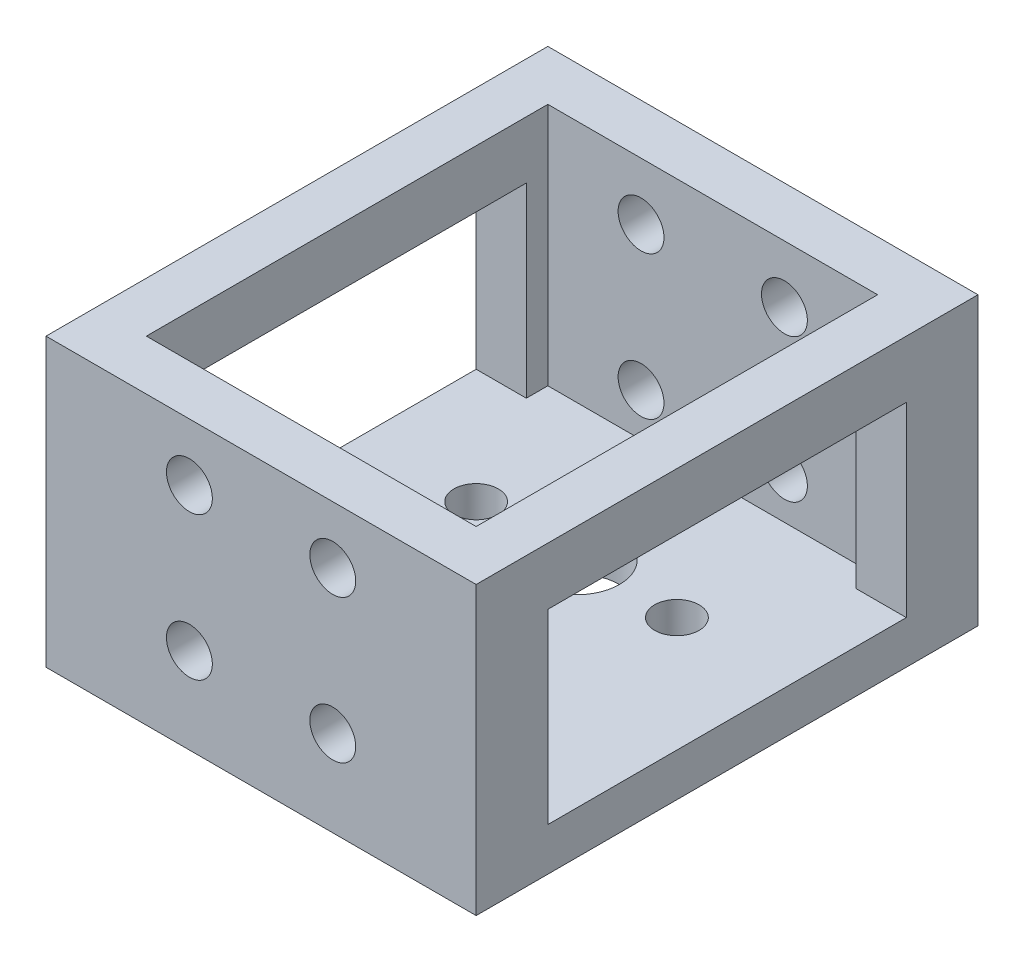
ISO-10303-21;
HEADER;
FILE_DESCRIPTION(('STEP AP214'),'2;1');
FILE_NAME('part.step','',(''),(''),'','','');
FILE_SCHEMA(('AUTOMOTIVE_DESIGN { 1 0 10303 214 1 1 1 1 }'));
ENDSEC;
DATA;
#1=APPLICATION_CONTEXT('core data for automotive mechanical design processes');
#2=APPLICATION_PROTOCOL_DEFINITION('international standard','automotive_design',2000,#1);
#3=PRODUCT_CONTEXT('',#1,'mechanical');
#4=PRODUCT('Part','Part','',(#3));
#5=PRODUCT_RELATED_PRODUCT_CATEGORY('part','',(#4));
#6=PRODUCT_DEFINITION_FORMATION('','',#4);
#7=PRODUCT_DEFINITION_CONTEXT('part definition',#1,'design');
#8=PRODUCT_DEFINITION('design','',#6,#7);
#9=PRODUCT_DEFINITION_SHAPE('','',#8);
#10=(LENGTH_UNIT() NAMED_UNIT(*) SI_UNIT(.MILLI.,.METRE.));
#11=(NAMED_UNIT(*) PLANE_ANGLE_UNIT() SI_UNIT($,.RADIAN.));
#12=(NAMED_UNIT(*) SI_UNIT($,.STERADIAN.) SOLID_ANGLE_UNIT());
#13=UNCERTAINTY_MEASURE_WITH_UNIT(LENGTH_MEASURE(1.E-05),#10,'distance_accuracy_value','');
#14=(GEOMETRIC_REPRESENTATION_CONTEXT(3) GLOBAL_UNCERTAINTY_ASSIGNED_CONTEXT((#13)) GLOBAL_UNIT_ASSIGNED_CONTEXT((#10,
#11,#12)) REPRESENTATION_CONTEXT('',''));
#15=CARTESIAN_POINT('',(0.,0.,0.));
#16=DIRECTION('',(0.,0.,1.));
#17=DIRECTION('',(1.,0.,0.));
#18=AXIS2_PLACEMENT_3D('',#15,#16,#17);
#19=CARTESIAN_POINT('',(11.5,20.,0.));
#20=DIRECTION('',(1.,0.,0.));
#21=DIRECTION('',(0.,0.,-1.));
#22=AXIS2_PLACEMENT_3D('',#19,#20,#21);
#23=PLANE('',#22);
#24=DIRECTION('',(0.,1.,0.));
#25=VECTOR('',#24,1.);
#26=CARTESIAN_POINT('',(11.5,20.,12.5));
#27=LINE('',#26,#25);
#28=CARTESIAN_POINT('',(11.5,3.,12.5));
#29=VERTEX_POINT('',#28);
#30=CARTESIAN_POINT('',(11.5,16.,12.5));
#31=VERTEX_POINT('',#30);
#32=EDGE_CURVE('E206',#29,#31,#27,.T.);
#33=ORIENTED_EDGE('',*,*,#32,.F.);
#34=DIRECTION('',(0.,0.,-1.));
#35=VECTOR('',#34,1.);
#36=CARTESIAN_POINT('',(11.5,3.,0.));
#37=LINE('',#36,#35);
#38=CARTESIAN_POINT('',(11.5,3.,14.));
#39=VERTEX_POINT('',#38);
#40=EDGE_CURVE('E273',#39,#29,#37,.T.);
#41=ORIENTED_EDGE('',*,*,#40,.F.);
#42=DIRECTION('',(0.,-1.,0.));
#43=VECTOR('',#42,1.);
#44=CARTESIAN_POINT('',(11.5,20.,14.));
#45=LINE('',#44,#43);
#46=CARTESIAN_POINT('',(11.5,20.,14.));
#47=VERTEX_POINT('',#46);
#48=EDGE_CURVE('E250',#47,#39,#45,.T.);
#49=ORIENTED_EDGE('',*,*,#48,.F.);
#50=DIRECTION('',(0.,0.,1.));
#51=VECTOR('',#50,1.);
#52=CARTESIAN_POINT('',(11.5,20.,0.));
#53=LINE('',#52,#51);
#54=CARTESIAN_POINT('',(11.5,20.,-14.));
#55=VERTEX_POINT('',#54);
#56=EDGE_CURVE('E226',#55,#47,#53,.T.);
#57=ORIENTED_EDGE('',*,*,#56,.F.);
#58=DIRECTION('',(0.,-1.,0.));
#59=VECTOR('',#58,1.);
#60=CARTESIAN_POINT('',(11.5,20.,-14.));
#61=LINE('',#60,#59);
#62=CARTESIAN_POINT('',(11.5,3.,-14.));
#63=VERTEX_POINT('',#62);
#64=EDGE_CURVE('E241',#55,#63,#61,.T.);
#65=ORIENTED_EDGE('',*,*,#64,.T.);
#66=CARTESIAN_POINT('',(11.5,3.,-12.5));
#67=VERTEX_POINT('',#66);
#68=EDGE_CURVE('E272',#67,#63,#37,.T.);
#69=ORIENTED_EDGE('',*,*,#68,.F.);
#70=DIRECTION('',(0.,-1.,0.));
#71=VECTOR('',#70,1.);
#72=CARTESIAN_POINT('',(11.5,20.,-12.5));
#73=LINE('',#72,#71);
#74=CARTESIAN_POINT('',(11.5,16.,-12.5));
#75=VERTEX_POINT('',#74);
#76=EDGE_CURVE('E201',#75,#67,#73,.T.);
#77=ORIENTED_EDGE('',*,*,#76,.F.);
#78=DIRECTION('',(0.,0.,-1.));
#79=VECTOR('',#78,1.);
#80=CARTESIAN_POINT('',(11.5,16.,0.));
#81=LINE('',#80,#79);
#82=EDGE_CURVE('E163',#31,#75,#81,.T.);
#83=ORIENTED_EDGE('',*,*,#82,.F.);
#84=EDGE_LOOP('',(#33,#41,#49,#57,#65,#69,#77,#83));
#85=FACE_BOUND('',#84,.T.);
#86=ADVANCED_FACE('F37',(#85),#23,.F.);
#87=CARTESIAN_POINT('',(-11.5,20.,0.));
#88=DIRECTION('',(1.,0.,0.));
#89=DIRECTION('',(0.,0.,-1.));
#90=AXIS2_PLACEMENT_3D('',#87,#88,#89);
#91=PLANE('',#90);
#92=DIRECTION('',(0.,0.,-1.));
#93=VECTOR('',#92,1.);
#94=CARTESIAN_POINT('',(-11.5,3.,0.));
#95=LINE('',#94,#93);
#96=CARTESIAN_POINT('',(-11.5,3.,14.));
#97=VERTEX_POINT('',#96);
#98=CARTESIAN_POINT('',(-11.5,3.,12.5));
#99=VERTEX_POINT('',#98);
#100=EDGE_CURVE('E266',#97,#99,#95,.T.);
#101=ORIENTED_EDGE('',*,*,#100,.T.);
#102=DIRECTION('',(0.,1.,0.));
#103=VECTOR('',#102,1.);
#104=CARTESIAN_POINT('',(-11.5,20.,12.5));
#105=LINE('',#104,#103);
#106=CARTESIAN_POINT('',(-11.5,16.,12.5));
#107=VERTEX_POINT('',#106);
#108=EDGE_CURVE('E203',#99,#107,#105,.T.);
#109=ORIENTED_EDGE('',*,*,#108,.T.);
#110=DIRECTION('',(0.,0.,-1.));
#111=VECTOR('',#110,1.);
#112=CARTESIAN_POINT('',(-11.5,16.,0.));
#113=LINE('',#112,#111);
#114=CARTESIAN_POINT('',(-11.5,16.,-12.5));
#115=VERTEX_POINT('',#114);
#116=EDGE_CURVE('E208',#107,#115,#113,.T.);
#117=ORIENTED_EDGE('',*,*,#116,.T.);
#118=DIRECTION('',(0.,-1.,0.));
#119=VECTOR('',#118,1.);
#120=CARTESIAN_POINT('',(-11.5,20.,-12.5));
#121=LINE('',#120,#119);
#122=CARTESIAN_POINT('',(-11.5,3.,-12.5));
#123=VERTEX_POINT('',#122);
#124=EDGE_CURVE('E193',#115,#123,#121,.T.);
#125=ORIENTED_EDGE('',*,*,#124,.T.);
#126=CARTESIAN_POINT('',(-11.5,3.,-14.));
#127=VERTEX_POINT('',#126);
#128=EDGE_CURVE('E265',#123,#127,#95,.T.);
#129=ORIENTED_EDGE('',*,*,#128,.T.);
#130=DIRECTION('',(0.,-1.,0.));
#131=VECTOR('',#130,1.);
#132=CARTESIAN_POINT('',(-11.5,20.,-14.));
#133=LINE('',#132,#131);
#134=CARTESIAN_POINT('',(-11.5,20.,-14.));
#135=VERTEX_POINT('',#134);
#136=EDGE_CURVE('E244',#135,#127,#133,.T.);
#137=ORIENTED_EDGE('',*,*,#136,.F.);
#138=DIRECTION('',(0.,0.,1.));
#139=VECTOR('',#138,1.);
#140=CARTESIAN_POINT('',(-11.5,20.,0.));
#141=LINE('',#140,#139);
#142=CARTESIAN_POINT('',(-11.5,20.,14.));
#143=VERTEX_POINT('',#142);
#144=EDGE_CURVE('E231',#135,#143,#141,.T.);
#145=ORIENTED_EDGE('',*,*,#144,.T.);
#146=DIRECTION('',(0.,-1.,0.));
#147=VECTOR('',#146,1.);
#148=CARTESIAN_POINT('',(-11.5,20.,14.));
#149=LINE('',#148,#147);
#150=EDGE_CURVE('E248',#143,#97,#149,.T.);
#151=ORIENTED_EDGE('',*,*,#150,.T.);
#152=EDGE_LOOP('',(#101,#109,#117,#125,#129,#137,#145,#151));
#153=FACE_BOUND('',#152,.T.);
#154=ADVANCED_FACE('F332',(#153),#91,.T.);
#155=CARTESIAN_POINT('',(15.,20.,0.));
#156=DIRECTION('',(1.,0.,0.));
#157=DIRECTION('',(0.,0.,-1.));
#158=AXIS2_PLACEMENT_3D('',#155,#156,#157);
#159=PLANE('',#158);
#160=DIRECTION('',(0.,0.,1.));
#161=VECTOR('',#160,1.);
#162=CARTESIAN_POINT('',(15.,0.,0.));
#163=LINE('',#162,#161);
#164=CARTESIAN_POINT('',(15.,0.,-17.5));
#165=VERTEX_POINT('',#164);
#166=CARTESIAN_POINT('',(15.,0.,17.5));
#167=VERTEX_POINT('',#166);
#168=EDGE_CURVE('E212',#165,#167,#163,.T.);
#169=ORIENTED_EDGE('',*,*,#168,.F.);
#170=DIRECTION('',(0.,-1.,0.));
#171=VECTOR('',#170,1.);
#172=CARTESIAN_POINT('',(15.,20.,-17.5));
#173=LINE('',#172,#171);
#174=CARTESIAN_POINT('',(15.,20.,-17.5));
#175=VERTEX_POINT('',#174);
#176=EDGE_CURVE('E258',#175,#165,#173,.T.);
#177=ORIENTED_EDGE('',*,*,#176,.F.);
#178=DIRECTION('',(0.,0.,1.));
#179=VECTOR('',#178,1.);
#180=CARTESIAN_POINT('',(15.,20.,0.));
#181=LINE('',#180,#179);
#182=CARTESIAN_POINT('',(15.,20.,17.5));
#183=VERTEX_POINT('',#182);
#184=EDGE_CURVE('E216',#175,#183,#181,.T.);
#185=ORIENTED_EDGE('',*,*,#184,.T.);
#186=DIRECTION('',(0.,-1.,0.));
#187=VECTOR('',#186,1.);
#188=CARTESIAN_POINT('',(15.,20.,17.5));
#189=LINE('',#188,#187);
#190=EDGE_CURVE('E245',#183,#167,#189,.T.);
#191=ORIENTED_EDGE('',*,*,#190,.T.);
#192=EDGE_LOOP('',(#169,#177,#185,#191));
#193=FACE_BOUND('',#192,.T.);
#194=DIRECTION('',(0.,-1.,0.));
#195=VECTOR('',#194,1.);
#196=CARTESIAN_POINT('',(15.,0.,12.5));
#197=LINE('',#196,#195);
#198=CARTESIAN_POINT('',(15.,16.,12.5));
#199=VERTEX_POINT('',#198);
#200=CARTESIAN_POINT('',(15.,3.,12.5));
#201=VERTEX_POINT('',#200);
#202=EDGE_CURVE('E170',#199,#201,#197,.T.);
#203=ORIENTED_EDGE('',*,*,#202,.F.);
#204=DIRECTION('',(0.,0.,1.));
#205=VECTOR('',#204,1.);
#206=CARTESIAN_POINT('',(15.,16.,0.));
#207=LINE('',#206,#205);
#208=CARTESIAN_POINT('',(15.,16.,-12.5));
#209=VERTEX_POINT('',#208);
#210=EDGE_CURVE('E156',#209,#199,#207,.T.);
#211=ORIENTED_EDGE('',*,*,#210,.F.);
#212=DIRECTION('',(0.,1.,0.));
#213=VECTOR('',#212,1.);
#214=CARTESIAN_POINT('',(15.,0.,-12.5));
#215=LINE('',#214,#213);
#216=CARTESIAN_POINT('',(15.,3.,-12.5));
#217=VERTEX_POINT('',#216);
#218=EDGE_CURVE('E151',#217,#209,#215,.T.);
#219=ORIENTED_EDGE('',*,*,#218,.F.);
#220=DIRECTION('',(0.,0.,1.));
#221=VECTOR('',#220,1.);
#222=CARTESIAN_POINT('',(15.,3.,0.));
#223=LINE('',#222,#221);
#224=EDGE_CURVE('E62',#217,#201,#223,.T.);
#225=ORIENTED_EDGE('',*,*,#224,.T.);
#226=EDGE_LOOP('',(#203,#211,#219,#225));
#227=FACE_BOUND('',#226,.T.);
#228=ADVANCED_FACE('F169',(#193,#227),#159,.T.);
#229=CARTESIAN_POINT('',(-15.,20.,0.));
#230=DIRECTION('',(-1.,0.,0.));
#231=DIRECTION('',(0.,0.,1.));
#232=AXIS2_PLACEMENT_3D('',#229,#230,#231);
#233=PLANE('',#232);
#234=DIRECTION('',(0.,0.,-1.));
#235=VECTOR('',#234,1.);
#236=CARTESIAN_POINT('',(-15.,0.,0.));
#237=LINE('',#236,#235);
#238=CARTESIAN_POINT('',(-15.,0.,17.5));
#239=VERTEX_POINT('',#238);
#240=CARTESIAN_POINT('',(-15.,0.,-17.5));
#241=VERTEX_POINT('',#240);
#242=EDGE_CURVE('E217',#239,#241,#237,.T.);
#243=ORIENTED_EDGE('',*,*,#242,.F.);
#244=DIRECTION('',(0.,-1.,0.));
#245=VECTOR('',#244,1.);
#246=CARTESIAN_POINT('',(-15.,20.,17.5));
#247=LINE('',#246,#245);
#248=CARTESIAN_POINT('',(-15.,20.,17.5));
#249=VERTEX_POINT('',#248);
#250=EDGE_CURVE('E236',#249,#239,#247,.T.);
#251=ORIENTED_EDGE('',*,*,#250,.F.);
#252=DIRECTION('',(0.,0.,-1.));
#253=VECTOR('',#252,1.);
#254=CARTESIAN_POINT('',(-15.,20.,0.));
#255=LINE('',#254,#253);
#256=CARTESIAN_POINT('',(-15.,20.,-17.5));
#257=VERTEX_POINT('',#256);
#258=EDGE_CURVE('E223',#249,#257,#255,.T.);
#259=ORIENTED_EDGE('',*,*,#258,.T.);
#260=DIRECTION('',(0.,-1.,0.));
#261=VECTOR('',#260,1.);
#262=CARTESIAN_POINT('',(-15.,20.,-17.5));
#263=LINE('',#262,#261);
#264=EDGE_CURVE('E255',#257,#241,#263,.T.);
#265=ORIENTED_EDGE('',*,*,#264,.T.);
#266=EDGE_LOOP('',(#243,#251,#259,#265));
#267=FACE_BOUND('',#266,.T.);
#268=DIRECTION('',(0.,1.,0.));
#269=VECTOR('',#268,1.);
#270=CARTESIAN_POINT('',(-15.,0.,-12.5));
#271=LINE('',#270,#269);
#272=CARTESIAN_POINT('',(-15.,3.,-12.5));
#273=VERTEX_POINT('',#272);
#274=CARTESIAN_POINT('',(-15.,16.,-12.5));
#275=VERTEX_POINT('',#274);
#276=EDGE_CURVE('E185',#273,#275,#271,.T.);
#277=ORIENTED_EDGE('',*,*,#276,.T.);
#278=DIRECTION('',(0.,0.,1.));
#279=VECTOR('',#278,1.);
#280=CARTESIAN_POINT('',(-15.,16.,0.));
#281=LINE('',#280,#279);
#282=CARTESIAN_POINT('',(-15.,16.,12.5));
#283=VERTEX_POINT('',#282);
#284=EDGE_CURVE('E182',#275,#283,#281,.T.);
#285=ORIENTED_EDGE('',*,*,#284,.T.);
#286=DIRECTION('',(0.,-1.,0.));
#287=VECTOR('',#286,1.);
#288=CARTESIAN_POINT('',(-15.,0.,12.5));
#289=LINE('',#288,#287);
#290=CARTESIAN_POINT('',(-15.,3.,12.5));
#291=VERTEX_POINT('',#290);
#292=EDGE_CURVE('E171',#283,#291,#289,.T.);
#293=ORIENTED_EDGE('',*,*,#292,.T.);
#294=DIRECTION('',(0.,0.,1.));
#295=VECTOR('',#294,1.);
#296=CARTESIAN_POINT('',(-15.,3.,0.));
#297=LINE('',#296,#295);
#298=EDGE_CURVE('E174',#273,#291,#297,.T.);
#299=ORIENTED_EDGE('',*,*,#298,.F.);
#300=EDGE_LOOP('',(#277,#285,#293,#299));
#301=FACE_BOUND('',#300,.T.);
#302=ADVANCED_FACE('F317',(#267,#301),#233,.T.);
#303=CARTESIAN_POINT('',(0.,20.,14.));
#304=DIRECTION('',(0.,0.,1.));
#305=DIRECTION('',(1.,0.,0.));
#306=AXIS2_PLACEMENT_3D('',#303,#304,#305);
#307=PLANE('',#306);
#308=CARTESIAN_POINT('',(5.,6.,14.));
#309=DIRECTION('',(0.,0.,1.));
#310=DIRECTION('',(1.,0.,0.));
#311=AXIS2_PLACEMENT_3D('',#308,#309,#310);
#312=CIRCLE('',#311,1.6);
#313=CARTESIAN_POINT('',(6.6,6.,14.));
#314=VERTEX_POINT('',#313);
#315=EDGE_CURVE('E400',#314,#314,#312,.T.);
#316=ORIENTED_EDGE('',*,*,#315,.T.);
#317=EDGE_LOOP('',(#316));
#318=FACE_BOUND('',#317,.T.);
#319=CARTESIAN_POINT('',(5.,16.,14.));
#320=DIRECTION('',(0.,0.,1.));
#321=DIRECTION('',(1.,0.,0.));
#322=AXIS2_PLACEMENT_3D('',#319,#320,#321);
#323=CIRCLE('',#322,1.6);
#324=CARTESIAN_POINT('',(6.6,16.,14.));
#325=VERTEX_POINT('',#324);
#326=EDGE_CURVE('E481',#325,#325,#323,.T.);
#327=ORIENTED_EDGE('',*,*,#326,.T.);
#328=EDGE_LOOP('',(#327));
#329=FACE_BOUND('',#328,.T.);
#330=CARTESIAN_POINT('',(-5.,16.,14.));
#331=DIRECTION('',(0.,0.,1.));
#332=DIRECTION('',(1.,0.,0.));
#333=AXIS2_PLACEMENT_3D('',#330,#331,#332);
#334=CIRCLE('',#333,1.6);
#335=CARTESIAN_POINT('',(-3.4,16.,14.));
#336=VERTEX_POINT('',#335);
#337=EDGE_CURVE('E489',#336,#336,#334,.T.);
#338=ORIENTED_EDGE('',*,*,#337,.T.);
#339=EDGE_LOOP('',(#338));
#340=FACE_BOUND('',#339,.T.);
#341=CARTESIAN_POINT('',(-5.,5.99999999999999,14.));
#342=DIRECTION('',(0.,0.,1.));
#343=DIRECTION('',(1.,0.,0.));
#344=AXIS2_PLACEMENT_3D('',#341,#342,#343);
#345=CIRCLE('',#344,1.6);
#346=CARTESIAN_POINT('',(-3.4,5.99999999999999,14.));
#347=VERTEX_POINT('',#346);
#348=EDGE_CURVE('E411',#347,#347,#345,.T.);
#349=ORIENTED_EDGE('',*,*,#348,.T.);
#350=EDGE_LOOP('',(#349));
#351=FACE_BOUND('',#350,.T.);
#352=ORIENTED_EDGE('',*,*,#48,.T.);
#353=DIRECTION('',(1.,0.,0.));
#354=VECTOR('',#353,1.);
#355=CARTESIAN_POINT('',(0.,3.,14.));
#356=LINE('',#355,#354);
#357=EDGE_CURVE('E269',#97,#39,#356,.T.);
#358=ORIENTED_EDGE('',*,*,#357,.F.);
#359=ORIENTED_EDGE('',*,*,#150,.F.);
#360=DIRECTION('',(-1.,0.,0.));
#361=VECTOR('',#360,1.);
#362=CARTESIAN_POINT('',(0.,20.,14.));
#363=LINE('',#362,#361);
#364=EDGE_CURVE('E229',#47,#143,#363,.T.);
#365=ORIENTED_EDGE('',*,*,#364,.F.);
#366=EDGE_LOOP('',(#352,#358,#359,#365));
#367=FACE_BOUND('',#366,.T.);
#368=ADVANCED_FACE('F320',(#318,#329,#340,#351,#367),#307,.F.);
#369=CARTESIAN_POINT('',(0.,20.,-14.));
#370=DIRECTION('',(0.,0.,-1.));
#371=DIRECTION('',(-1.,0.,0.));
#372=AXIS2_PLACEMENT_3D('',#369,#370,#371);
#373=PLANE('',#372);
#374=CARTESIAN_POINT('',(5.,6.,-14.));
#375=DIRECTION('',(0.,0.,-1.));
#376=DIRECTION('',(-1.,0.,0.));
#377=AXIS2_PLACEMENT_3D('',#374,#375,#376);
#378=CIRCLE('',#377,1.6);
#379=CARTESIAN_POINT('',(3.4,6.,-14.));
#380=VERTEX_POINT('',#379);
#381=EDGE_CURVE('E406',#380,#380,#378,.T.);
#382=ORIENTED_EDGE('',*,*,#381,.T.);
#383=EDGE_LOOP('',(#382));
#384=FACE_BOUND('',#383,.T.);
#385=CARTESIAN_POINT('',(5.,16.,-14.));
#386=DIRECTION('',(0.,0.,-1.));
#387=DIRECTION('',(-1.,0.,0.));
#388=AXIS2_PLACEMENT_3D('',#385,#386,#387);
#389=CIRCLE('',#388,1.6);
#390=CARTESIAN_POINT('',(3.4,16.,-14.));
#391=VERTEX_POINT('',#390);
#392=EDGE_CURVE('E484',#391,#391,#389,.T.);
#393=ORIENTED_EDGE('',*,*,#392,.T.);
#394=EDGE_LOOP('',(#393));
#395=FACE_BOUND('',#394,.T.);
#396=CARTESIAN_POINT('',(-5.,16.,-14.));
#397=DIRECTION('',(0.,0.,-1.));
#398=DIRECTION('',(-1.,0.,0.));
#399=AXIS2_PLACEMENT_3D('',#396,#397,#398);
#400=CIRCLE('',#399,1.6);
#401=CARTESIAN_POINT('',(-6.6,16.,-14.));
#402=VERTEX_POINT('',#401);
#403=EDGE_CURVE('E492',#402,#402,#400,.T.);
#404=ORIENTED_EDGE('',*,*,#403,.T.);
#405=EDGE_LOOP('',(#404));
#406=FACE_BOUND('',#405,.T.);
#407=CARTESIAN_POINT('',(-5.,5.99999999999999,-14.));
#408=DIRECTION('',(0.,0.,-1.));
#409=DIRECTION('',(-1.,0.,0.));
#410=AXIS2_PLACEMENT_3D('',#407,#408,#409);
#411=CIRCLE('',#410,1.6);
#412=CARTESIAN_POINT('',(-6.6,5.99999999999999,-14.));
#413=VERTEX_POINT('',#412);
#414=EDGE_CURVE('E403',#413,#413,#411,.T.);
#415=ORIENTED_EDGE('',*,*,#414,.T.);
#416=EDGE_LOOP('',(#415));
#417=FACE_BOUND('',#416,.T.);
#418=ORIENTED_EDGE('',*,*,#136,.T.);
#419=DIRECTION('',(-1.,0.,0.));
#420=VECTOR('',#419,1.);
#421=CARTESIAN_POINT('',(0.,3.,-14.));
#422=LINE('',#421,#420);
#423=EDGE_CURVE('E252',#63,#127,#422,.T.);
#424=ORIENTED_EDGE('',*,*,#423,.F.);
#425=ORIENTED_EDGE('',*,*,#64,.F.);
#426=DIRECTION('',(1.,0.,0.));
#427=VECTOR('',#426,1.);
#428=CARTESIAN_POINT('',(0.,20.,-14.));
#429=LINE('',#428,#427);
#430=EDGE_CURVE('E234',#135,#55,#429,.T.);
#431=ORIENTED_EDGE('',*,*,#430,.F.);
#432=EDGE_LOOP('',(#418,#424,#425,#431));
#433=FACE_BOUND('',#432,.T.);
#434=ADVANCED_FACE('F342',(#384,#395,#406,#417,#433),#373,.F.);
#435=CARTESIAN_POINT('',(0.,20.,0.));
#436=DIRECTION('',(0.,1.,0.));
#437=DIRECTION('',(0.,0.,1.));
#438=AXIS2_PLACEMENT_3D('',#435,#436,#437);
#439=PLANE('',#438);
#440=DIRECTION('',(-1.,0.,0.));
#441=VECTOR('',#440,1.);
#442=CARTESIAN_POINT('',(0.,20.,17.5));
#443=LINE('',#442,#441);
#444=EDGE_CURVE('E213',#183,#249,#443,.T.);
#445=ORIENTED_EDGE('',*,*,#444,.F.);
#446=ORIENTED_EDGE('',*,*,#184,.F.);
#447=DIRECTION('',(1.,0.,0.));
#448=VECTOR('',#447,1.);
#449=CARTESIAN_POINT('',(0.,20.,-17.5));
#450=LINE('',#449,#448);
#451=EDGE_CURVE('E220',#257,#175,#450,.T.);
#452=ORIENTED_EDGE('',*,*,#451,.F.);
#453=ORIENTED_EDGE('',*,*,#258,.F.);
#454=EDGE_LOOP('',(#445,#446,#452,#453));
#455=FACE_BOUND('',#454,.T.);
#456=ORIENTED_EDGE('',*,*,#56,.T.);
#457=ORIENTED_EDGE('',*,*,#364,.T.);
#458=ORIENTED_EDGE('',*,*,#144,.F.);
#459=ORIENTED_EDGE('',*,*,#430,.T.);
#460=EDGE_LOOP('',(#456,#457,#458,#459));
#461=FACE_BOUND('',#460,.T.);
#462=ADVANCED_FACE('F314',(#455,#461),#439,.T.);
#463=CARTESIAN_POINT('',(0.,3.,17.5));
#464=DIRECTION('',(0.,0.,1.));
#465=DIRECTION('',(1.,0.,0.));
#466=AXIS2_PLACEMENT_3D('',#463,#464,#465);
#467=PLANE('',#466);
#468=CARTESIAN_POINT('',(5.,6.,17.5));
#469=DIRECTION('',(0.,0.,-1.));
#470=DIRECTION('',(-1.,0.,0.));
#471=AXIS2_PLACEMENT_3D('',#468,#469,#470);
#472=CIRCLE('',#471,1.6);
#473=CARTESIAN_POINT('',(3.4,6.,17.5));
#474=VERTEX_POINT('',#473);
#475=EDGE_CURVE('E495',#474,#474,#472,.T.);
#476=ORIENTED_EDGE('',*,*,#475,.T.);
#477=EDGE_LOOP('',(#476));
#478=FACE_BOUND('',#477,.T.);
#479=CARTESIAN_POINT('',(5.,16.,17.5));
#480=DIRECTION('',(0.,0.,-1.));
#481=DIRECTION('',(-1.,0.,0.));
#482=AXIS2_PLACEMENT_3D('',#479,#480,#481);
#483=CIRCLE('',#482,1.6);
#484=CARTESIAN_POINT('',(3.4,16.,17.5));
#485=VERTEX_POINT('',#484);
#486=EDGE_CURVE('E501',#485,#485,#483,.T.);
#487=ORIENTED_EDGE('',*,*,#486,.T.);
#488=EDGE_LOOP('',(#487));
#489=FACE_BOUND('',#488,.T.);
#490=CARTESIAN_POINT('',(-5.,16.,17.5));
#491=DIRECTION('',(0.,0.,-1.));
#492=DIRECTION('',(-1.,0.,0.));
#493=AXIS2_PLACEMENT_3D('',#490,#491,#492);
#494=CIRCLE('',#493,1.6);
#495=CARTESIAN_POINT('',(-6.6,16.,17.5));
#496=VERTEX_POINT('',#495);
#497=EDGE_CURVE('E497',#496,#496,#494,.T.);
#498=ORIENTED_EDGE('',*,*,#497,.T.);
#499=EDGE_LOOP('',(#498));
#500=FACE_BOUND('',#499,.T.);
#501=CARTESIAN_POINT('',(-5.,5.99999999999999,17.5));
#502=DIRECTION('',(0.,0.,-1.));
#503=DIRECTION('',(-1.,0.,0.));
#504=AXIS2_PLACEMENT_3D('',#501,#502,#503);
#505=CIRCLE('',#504,1.6);
#506=CARTESIAN_POINT('',(-6.6,5.99999999999999,17.5));
#507=VERTEX_POINT('',#506);
#508=EDGE_CURVE('E399',#507,#507,#505,.T.);
#509=ORIENTED_EDGE('',*,*,#508,.T.);
#510=EDGE_LOOP('',(#509));
#511=FACE_BOUND('',#510,.T.);
#512=ORIENTED_EDGE('',*,*,#250,.T.);
#513=DIRECTION('',(-1.,0.,0.));
#514=VECTOR('',#513,1.);
#515=CARTESIAN_POINT('',(0.,0.,17.5));
#516=LINE('',#515,#514);
#517=EDGE_CURVE('E46',#167,#239,#516,.T.);
#518=ORIENTED_EDGE('',*,*,#517,.F.);
#519=ORIENTED_EDGE('',*,*,#190,.F.);
#520=ORIENTED_EDGE('',*,*,#444,.T.);
#521=EDGE_LOOP('',(#512,#518,#519,#520));
#522=FACE_BOUND('',#521,.T.);
#523=ADVANCED_FACE('F39',(#478,#489,#500,#511,#522),#467,.T.);
#524=CARTESIAN_POINT('',(0.,3.,-17.5));
#525=DIRECTION('',(0.,0.,-1.));
#526=DIRECTION('',(-1.,0.,0.));
#527=AXIS2_PLACEMENT_3D('',#524,#525,#526);
#528=PLANE('',#527);
#529=CARTESIAN_POINT('',(5.,6.,-17.5));
#530=DIRECTION('',(0.,0.,-1.));
#531=DIRECTION('',(-1.,0.,0.));
#532=AXIS2_PLACEMENT_3D('',#529,#530,#531);
#533=CIRCLE('',#532,1.6);
#534=CARTESIAN_POINT('',(3.4,6.,-17.5));
#535=VERTEX_POINT('',#534);
#536=EDGE_CURVE('E386',#535,#535,#533,.T.);
#537=ORIENTED_EDGE('',*,*,#536,.F.);
#538=EDGE_LOOP('',(#537));
#539=FACE_BOUND('',#538,.T.);
#540=CARTESIAN_POINT('',(5.,16.,-17.5));
#541=DIRECTION('',(0.,0.,-1.));
#542=DIRECTION('',(-1.,0.,0.));
#543=AXIS2_PLACEMENT_3D('',#540,#541,#542);
#544=CIRCLE('',#543,1.6);
#545=CARTESIAN_POINT('',(3.4,16.,-17.5));
#546=VERTEX_POINT('',#545);
#547=EDGE_CURVE('E390',#546,#546,#544,.T.);
#548=ORIENTED_EDGE('',*,*,#547,.F.);
#549=EDGE_LOOP('',(#548));
#550=FACE_BOUND('',#549,.T.);
#551=CARTESIAN_POINT('',(-5.,16.,-17.5));
#552=DIRECTION('',(0.,0.,-1.));
#553=DIRECTION('',(-1.,0.,0.));
#554=AXIS2_PLACEMENT_3D('',#551,#552,#553);
#555=CIRCLE('',#554,1.6);
#556=CARTESIAN_POINT('',(-6.6,16.,-17.5));
#557=VERTEX_POINT('',#556);
#558=EDGE_CURVE('E394',#557,#557,#555,.T.);
#559=ORIENTED_EDGE('',*,*,#558,.F.);
#560=EDGE_LOOP('',(#559));
#561=FACE_BOUND('',#560,.T.);
#562=CARTESIAN_POINT('',(-5.,5.99999999999999,-17.5));
#563=DIRECTION('',(0.,0.,-1.));
#564=DIRECTION('',(-1.,0.,0.));
#565=AXIS2_PLACEMENT_3D('',#562,#563,#564);
#566=CIRCLE('',#565,1.6);
#567=CARTESIAN_POINT('',(-6.6,5.99999999999999,-17.5));
#568=VERTEX_POINT('',#567);
#569=EDGE_CURVE('E397',#568,#568,#566,.T.);
#570=ORIENTED_EDGE('',*,*,#569,.F.);
#571=EDGE_LOOP('',(#570));
#572=FACE_BOUND('',#571,.T.);
#573=ORIENTED_EDGE('',*,*,#176,.T.);
#574=DIRECTION('',(1.,0.,0.));
#575=VECTOR('',#574,1.);
#576=CARTESIAN_POINT('',(0.,0.,-17.5));
#577=LINE('',#576,#575);
#578=EDGE_CURVE('E11',#241,#165,#577,.T.);
#579=ORIENTED_EDGE('',*,*,#578,.F.);
#580=ORIENTED_EDGE('',*,*,#264,.F.);
#581=ORIENTED_EDGE('',*,*,#451,.T.);
#582=EDGE_LOOP('',(#573,#579,#580,#581));
#583=FACE_BOUND('',#582,.T.);
#584=ADVANCED_FACE('F301',(#539,#550,#561,#572,#583),#528,.T.);
#585=CARTESIAN_POINT('',(0.,0.,0.));
#586=DIRECTION('',(0.,1.,0.));
#587=DIRECTION('',(0.,0.,1.));
#588=AXIS2_PLACEMENT_3D('',#585,#586,#587);
#589=PLANE('',#588);
#590=CARTESIAN_POINT('',(0.,0.,-4.49999999999999));
#591=DIRECTION('',(0.,-1.,0.));
#592=DIRECTION('',(0.,0.,-1.));
#593=AXIS2_PLACEMENT_3D('',#590,#591,#592);
#594=CIRCLE('',#593,3.);
#595=CARTESIAN_POINT('',(0.,0.,-7.49999999999999));
#596=VERTEX_POINT('',#595);
#597=EDGE_CURVE('E414',#596,#596,#594,.T.);
#598=ORIENTED_EDGE('',*,*,#597,.F.);
#599=EDGE_LOOP('',(#598));
#600=FACE_BOUND('',#599,.T.);
#601=CARTESIAN_POINT('',(-7.,0.,-4.49999999999999));
#602=DIRECTION('',(0.,-1.,0.));
#603=DIRECTION('',(0.,0.,-1.));
#604=AXIS2_PLACEMENT_3D('',#601,#602,#603);
#605=CIRCLE('',#604,1.55);
#606=CARTESIAN_POINT('',(-7.,0.,-6.04999999999999));
#607=VERTEX_POINT('',#606);
#608=EDGE_CURVE('E415',#607,#607,#605,.T.);
#609=ORIENTED_EDGE('',*,*,#608,.F.);
#610=EDGE_LOOP('',(#609));
#611=FACE_BOUND('',#610,.T.);
#612=CARTESIAN_POINT('',(7.,0.,-4.49999999999999));
#613=DIRECTION('',(0.,-1.,0.));
#614=DIRECTION('',(0.,0.,-1.));
#615=AXIS2_PLACEMENT_3D('',#612,#613,#614);
#616=CIRCLE('',#615,1.55);
#617=CARTESIAN_POINT('',(7.,0.,-6.04999999999999));
#618=VERTEX_POINT('',#617);
#619=EDGE_CURVE('E418',#618,#618,#616,.T.);
#620=ORIENTED_EDGE('',*,*,#619,.F.);
#621=EDGE_LOOP('',(#620));
#622=FACE_BOUND('',#621,.T.);
#623=CARTESIAN_POINT('',(0.,0.,-11.5));
#624=DIRECTION('',(0.,-1.,0.));
#625=DIRECTION('',(0.,0.,-1.));
#626=AXIS2_PLACEMENT_3D('',#623,#624,#625);
#627=CIRCLE('',#626,1.55);
#628=CARTESIAN_POINT('',(0.,0.,-13.05));
#629=VERTEX_POINT('',#628);
#630=EDGE_CURVE('E283',#629,#629,#627,.T.);
#631=ORIENTED_EDGE('',*,*,#630,.F.);
#632=EDGE_LOOP('',(#631));
#633=FACE_BOUND('',#632,.T.);
#634=CARTESIAN_POINT('',(0.,0.,2.50000000000001));
#635=DIRECTION('',(0.,-1.,0.));
#636=DIRECTION('',(0.,0.,-1.));
#637=AXIS2_PLACEMENT_3D('',#634,#635,#636);
#638=CIRCLE('',#637,1.55);
#639=CARTESIAN_POINT('',(0.,0.,0.950000000000009));
#640=VERTEX_POINT('',#639);
#641=EDGE_CURVE('E177',#640,#640,#638,.T.);
#642=ORIENTED_EDGE('',*,*,#641,.F.);
#643=EDGE_LOOP('',(#642));
#644=FACE_BOUND('',#643,.T.);
#645=ORIENTED_EDGE('',*,*,#578,.T.);
#646=ORIENTED_EDGE('',*,*,#168,.T.);
#647=ORIENTED_EDGE('',*,*,#517,.T.);
#648=ORIENTED_EDGE('',*,*,#242,.T.);
#649=EDGE_LOOP('',(#645,#646,#647,#648));
#650=FACE_BOUND('',#649,.T.);
#651=ADVANCED_FACE('F297',(#600,#611,#622,#633,#644,#650),#589,.F.);
#652=CARTESIAN_POINT('',(0.,3.,0.));
#653=DIRECTION('',(0.,1.,0.));
#654=DIRECTION('',(0.,0.,1.));
#655=AXIS2_PLACEMENT_3D('',#652,#653,#654);
#656=PLANE('',#655);
#657=CARTESIAN_POINT('',(0.,3.,-4.49999999999999));
#658=DIRECTION('',(0.,1.,0.));
#659=DIRECTION('',(0.,0.,1.));
#660=AXIS2_PLACEMENT_3D('',#657,#658,#659);
#661=CIRCLE('',#660,3.);
#662=CARTESIAN_POINT('',(0.,3.,-1.49999999999999));
#663=VERTEX_POINT('',#662);
#664=EDGE_CURVE('E41',#663,#663,#661,.T.);
#665=ORIENTED_EDGE('',*,*,#664,.F.);
#666=EDGE_LOOP('',(#665));
#667=FACE_BOUND('',#666,.T.);
#668=CARTESIAN_POINT('',(-7.,3.,-4.49999999999999));
#669=DIRECTION('',(0.,1.,0.));
#670=DIRECTION('',(0.,0.,1.));
#671=AXIS2_PLACEMENT_3D('',#668,#669,#670);
#672=CIRCLE('',#671,1.55);
#673=CARTESIAN_POINT('',(-7.,3.,-2.94999999999999));
#674=VERTEX_POINT('',#673);
#675=EDGE_CURVE('E285',#674,#674,#672,.T.);
#676=ORIENTED_EDGE('',*,*,#675,.F.);
#677=EDGE_LOOP('',(#676));
#678=FACE_BOUND('',#677,.T.);
#679=CARTESIAN_POINT('',(7.,3.,-4.49999999999999));
#680=DIRECTION('',(0.,1.,0.));
#681=DIRECTION('',(0.,0.,1.));
#682=AXIS2_PLACEMENT_3D('',#679,#680,#681);
#683=CIRCLE('',#682,1.55);
#684=CARTESIAN_POINT('',(7.,3.,-2.94999999999999));
#685=VERTEX_POINT('',#684);
#686=EDGE_CURVE('E282',#685,#685,#683,.T.);
#687=ORIENTED_EDGE('',*,*,#686,.F.);
#688=EDGE_LOOP('',(#687));
#689=FACE_BOUND('',#688,.T.);
#690=CARTESIAN_POINT('',(0.,3.,-11.5));
#691=DIRECTION('',(0.,1.,0.));
#692=DIRECTION('',(0.,0.,1.));
#693=AXIS2_PLACEMENT_3D('',#690,#691,#692);
#694=CIRCLE('',#693,1.55);
#695=CARTESIAN_POINT('',(0.,3.,-9.94999999999999));
#696=VERTEX_POINT('',#695);
#697=EDGE_CURVE('E279',#696,#696,#694,.T.);
#698=ORIENTED_EDGE('',*,*,#697,.F.);
#699=EDGE_LOOP('',(#698));
#700=FACE_BOUND('',#699,.T.);
#701=CARTESIAN_POINT('',(0.,3.,2.50000000000001));
#702=DIRECTION('',(0.,1.,0.));
#703=DIRECTION('',(0.,0.,1.));
#704=AXIS2_PLACEMENT_3D('',#701,#702,#703);
#705=CIRCLE('',#704,1.55);
#706=CARTESIAN_POINT('',(0.,3.,4.05000000000001));
#707=VERTEX_POINT('',#706);
#708=EDGE_CURVE('E186',#707,#707,#705,.T.);
#709=ORIENTED_EDGE('',*,*,#708,.F.);
#710=EDGE_LOOP('',(#709));
#711=FACE_BOUND('',#710,.T.);
#712=ORIENTED_EDGE('',*,*,#128,.F.);
#713=DIRECTION('',(-1.,0.,0.));
#714=VECTOR('',#713,1.);
#715=CARTESIAN_POINT('',(15.,3.,-12.5));
#716=LINE('',#715,#714);
#717=EDGE_CURVE('E165',#123,#273,#716,.T.);
#718=ORIENTED_EDGE('',*,*,#717,.T.);
#719=ORIENTED_EDGE('',*,*,#298,.T.);
#720=DIRECTION('',(-1.,0.,0.));
#721=VECTOR('',#720,1.);
#722=CARTESIAN_POINT('',(15.,3.,12.5));
#723=LINE('',#722,#721);
#724=EDGE_CURVE('E197',#99,#291,#723,.T.);
#725=ORIENTED_EDGE('',*,*,#724,.F.);
#726=ORIENTED_EDGE('',*,*,#100,.F.);
#727=ORIENTED_EDGE('',*,*,#357,.T.);
#728=ORIENTED_EDGE('',*,*,#40,.T.);
#729=EDGE_CURVE('E195',#201,#29,#723,.T.);
#730=ORIENTED_EDGE('',*,*,#729,.F.);
#731=ORIENTED_EDGE('',*,*,#224,.F.);
#732=EDGE_CURVE('E153',#217,#67,#716,.T.);
#733=ORIENTED_EDGE('',*,*,#732,.T.);
#734=ORIENTED_EDGE('',*,*,#68,.T.);
#735=ORIENTED_EDGE('',*,*,#423,.T.);
#736=EDGE_LOOP('',(#712,#718,#719,#725,#726,#727,#728,#730,#731,#733,#734,#735));
#737=FACE_BOUND('',#736,.T.);
#738=ADVANCED_FACE('F300',(#667,#678,#689,#700,#711,#737),#656,.T.);
#739=CARTESIAN_POINT('',(15.,0.,-12.5));
#740=DIRECTION('',(0.,0.,1.));
#741=DIRECTION('',(1.,0.,0.));
#742=AXIS2_PLACEMENT_3D('',#739,#740,#741);
#743=PLANE('',#742);
#744=DIRECTION('',(-1.,0.,0.));
#745=VECTOR('',#744,1.);
#746=CARTESIAN_POINT('',(15.,16.,-12.5));
#747=LINE('',#746,#745);
#748=EDGE_CURVE('E166',#115,#275,#747,.T.);
#749=ORIENTED_EDGE('',*,*,#748,.T.);
#750=ORIENTED_EDGE('',*,*,#276,.F.);
#751=ORIENTED_EDGE('',*,*,#717,.F.);
#752=ORIENTED_EDGE('',*,*,#124,.F.);
#753=EDGE_LOOP('',(#749,#750,#751,#752));
#754=FACE_BOUND('',#753,.T.);
#755=ADVANCED_FACE('F326',(#754),#743,.T.);
#756=CARTESIAN_POINT('',(15.,0.,12.5));
#757=DIRECTION('',(0.,0.,-1.));
#758=DIRECTION('',(0.,1.,0.));
#759=AXIS2_PLACEMENT_3D('',#756,#757,#758);
#760=PLANE('',#759);
#761=ORIENTED_EDGE('',*,*,#724,.T.);
#762=ORIENTED_EDGE('',*,*,#292,.F.);
#763=DIRECTION('',(-1.,0.,0.));
#764=VECTOR('',#763,1.);
#765=CARTESIAN_POINT('',(15.,16.,12.5));
#766=LINE('',#765,#764);
#767=EDGE_CURVE('E194',#107,#283,#766,.T.);
#768=ORIENTED_EDGE('',*,*,#767,.F.);
#769=ORIENTED_EDGE('',*,*,#108,.F.);
#770=EDGE_LOOP('',(#761,#762,#768,#769));
#771=FACE_BOUND('',#770,.T.);
#772=ADVANCED_FACE('F337',(#771),#760,.T.);
#773=CARTESIAN_POINT('',(15.,16.,0.));
#774=DIRECTION('',(0.,-1.,0.));
#775=DIRECTION('',(0.,0.,-1.));
#776=AXIS2_PLACEMENT_3D('',#773,#774,#775);
#777=PLANE('',#776);
#778=ORIENTED_EDGE('',*,*,#767,.T.);
#779=ORIENTED_EDGE('',*,*,#284,.F.);
#780=ORIENTED_EDGE('',*,*,#748,.F.);
#781=ORIENTED_EDGE('',*,*,#116,.F.);
#782=EDGE_LOOP('',(#778,#779,#780,#781));
#783=FACE_BOUND('',#782,.T.);
#784=ADVANCED_FACE('F329',(#783),#777,.T.);
#785=ORIENTED_EDGE('',*,*,#82,.T.);
#786=EDGE_CURVE('E54',#209,#75,#747,.T.);
#787=ORIENTED_EDGE('',*,*,#786,.F.);
#788=ORIENTED_EDGE('',*,*,#210,.T.);
#789=EDGE_CURVE('E191',#199,#31,#766,.T.);
#790=ORIENTED_EDGE('',*,*,#789,.T.);
#791=EDGE_LOOP('',(#785,#787,#788,#790));
#792=FACE_BOUND('',#791,.T.);
#793=ADVANCED_FACE('F159',(#792),#777,.T.);
#794=ORIENTED_EDGE('',*,*,#32,.T.);
#795=ORIENTED_EDGE('',*,*,#789,.F.);
#796=ORIENTED_EDGE('',*,*,#202,.T.);
#797=ORIENTED_EDGE('',*,*,#729,.T.);
#798=EDGE_LOOP('',(#794,#795,#796,#797));
#799=FACE_BOUND('',#798,.T.);
#800=ADVANCED_FACE('F354',(#799),#760,.T.);
#801=ORIENTED_EDGE('',*,*,#76,.T.);
#802=ORIENTED_EDGE('',*,*,#732,.F.);
#803=ORIENTED_EDGE('',*,*,#218,.T.);
#804=ORIENTED_EDGE('',*,*,#786,.T.);
#805=EDGE_LOOP('',(#801,#802,#803,#804));
#806=FACE_BOUND('',#805,.T.);
#807=ADVANCED_FACE('F152',(#806),#743,.T.);
#808=CARTESIAN_POINT('',(0.,20.,2.50000000000001));
#809=DIRECTION('',(0.,-1.,0.));
#810=DIRECTION('',(0.,0.,-1.));
#811=AXIS2_PLACEMENT_3D('',#808,#809,#810);
#812=CYLINDRICAL_SURFACE('',#811,1.55);
#813=ORIENTED_EDGE('',*,*,#708,.T.);
#814=EDGE_LOOP('',(#813));
#815=FACE_BOUND('',#814,.T.);
#816=ORIENTED_EDGE('',*,*,#641,.T.);
#817=EDGE_LOOP('',(#816));
#818=FACE_BOUND('',#817,.T.);
#819=ADVANCED_FACE('F295',(#815,#818),#812,.F.);
#820=CARTESIAN_POINT('',(0.,20.,-11.5));
#821=DIRECTION('',(0.,-1.,0.));
#822=DIRECTION('',(0.,0.,-1.));
#823=AXIS2_PLACEMENT_3D('',#820,#821,#822);
#824=CYLINDRICAL_SURFACE('',#823,1.55);
#825=ORIENTED_EDGE('',*,*,#697,.T.);
#826=EDGE_LOOP('',(#825));
#827=FACE_BOUND('',#826,.T.);
#828=ORIENTED_EDGE('',*,*,#630,.T.);
#829=EDGE_LOOP('',(#828));
#830=FACE_BOUND('',#829,.T.);
#831=ADVANCED_FACE('F430',(#827,#830),#824,.F.);
#832=CARTESIAN_POINT('',(7.,20.,-4.49999999999999));
#833=DIRECTION('',(0.,-1.,0.));
#834=DIRECTION('',(0.,0.,-1.));
#835=AXIS2_PLACEMENT_3D('',#832,#833,#834);
#836=CYLINDRICAL_SURFACE('',#835,1.55);
#837=ORIENTED_EDGE('',*,*,#686,.T.);
#838=EDGE_LOOP('',(#837));
#839=FACE_BOUND('',#838,.T.);
#840=ORIENTED_EDGE('',*,*,#619,.T.);
#841=EDGE_LOOP('',(#840));
#842=FACE_BOUND('',#841,.T.);
#843=ADVANCED_FACE('F425',(#839,#842),#836,.F.);
#844=CARTESIAN_POINT('',(-7.,20.,-4.49999999999999));
#845=DIRECTION('',(0.,-1.,0.));
#846=DIRECTION('',(0.,0.,-1.));
#847=AXIS2_PLACEMENT_3D('',#844,#845,#846);
#848=CYLINDRICAL_SURFACE('',#847,1.55);
#849=ORIENTED_EDGE('',*,*,#675,.T.);
#850=EDGE_LOOP('',(#849));
#851=FACE_BOUND('',#850,.T.);
#852=ORIENTED_EDGE('',*,*,#608,.T.);
#853=EDGE_LOOP('',(#852));
#854=FACE_BOUND('',#853,.T.);
#855=ADVANCED_FACE('F438',(#851,#854),#848,.F.);
#856=CARTESIAN_POINT('',(0.,20.,-4.49999999999999));
#857=DIRECTION('',(0.,-1.,0.));
#858=DIRECTION('',(0.,0.,-1.));
#859=AXIS2_PLACEMENT_3D('',#856,#857,#858);
#860=CYLINDRICAL_SURFACE('',#859,3.);
#861=ORIENTED_EDGE('',*,*,#664,.T.);
#862=EDGE_LOOP('',(#861));
#863=FACE_BOUND('',#862,.T.);
#864=ORIENTED_EDGE('',*,*,#597,.T.);
#865=EDGE_LOOP('',(#864));
#866=FACE_BOUND('',#865,.T.);
#867=ADVANCED_FACE('F443',(#863,#866),#860,.F.);
#868=CARTESIAN_POINT('',(-5.,5.99999999999999,17.5));
#869=DIRECTION('',(0.,0.,-1.));
#870=DIRECTION('',(-1.,0.,0.));
#871=AXIS2_PLACEMENT_3D('',#868,#869,#870);
#872=CYLINDRICAL_SURFACE('',#871,1.6);
#873=ORIENTED_EDGE('',*,*,#569,.T.);
#874=EDGE_LOOP('',(#873));
#875=FACE_BOUND('',#874,.T.);
#876=ORIENTED_EDGE('',*,*,#414,.F.);
#877=EDGE_LOOP('',(#876));
#878=FACE_BOUND('',#877,.T.);
#879=ADVANCED_FACE('F446',(#875,#878),#872,.F.);
#880=ORIENTED_EDGE('',*,*,#508,.F.);
#881=EDGE_LOOP('',(#880));
#882=FACE_BOUND('',#881,.T.);
#883=ORIENTED_EDGE('',*,*,#348,.F.);
#884=EDGE_LOOP('',(#883));
#885=FACE_BOUND('',#884,.T.);
#886=ADVANCED_FACE('F449',(#882,#885),#872,.F.);
#887=CARTESIAN_POINT('',(-5.,16.,17.5));
#888=DIRECTION('',(0.,0.,-1.));
#889=DIRECTION('',(-1.,0.,0.));
#890=AXIS2_PLACEMENT_3D('',#887,#888,#889);
#891=CYLINDRICAL_SURFACE('',#890,1.6);
#892=ORIENTED_EDGE('',*,*,#558,.T.);
#893=EDGE_LOOP('',(#892));
#894=FACE_BOUND('',#893,.T.);
#895=ORIENTED_EDGE('',*,*,#403,.F.);
#896=EDGE_LOOP('',(#895));
#897=FACE_BOUND('',#896,.T.);
#898=ADVANCED_FACE('F452',(#894,#897),#891,.F.);
#899=CARTESIAN_POINT('',(5.,16.,17.5));
#900=DIRECTION('',(0.,0.,-1.));
#901=DIRECTION('',(-1.,0.,0.));
#902=AXIS2_PLACEMENT_3D('',#899,#900,#901);
#903=CYLINDRICAL_SURFACE('',#902,1.6);
#904=ORIENTED_EDGE('',*,*,#547,.T.);
#905=EDGE_LOOP('',(#904));
#906=FACE_BOUND('',#905,.T.);
#907=ORIENTED_EDGE('',*,*,#392,.F.);
#908=EDGE_LOOP('',(#907));
#909=FACE_BOUND('',#908,.T.);
#910=ADVANCED_FACE('F464',(#906,#909),#903,.F.);
#911=CARTESIAN_POINT('',(5.,6.,17.5));
#912=DIRECTION('',(0.,0.,-1.));
#913=DIRECTION('',(-1.,0.,0.));
#914=AXIS2_PLACEMENT_3D('',#911,#912,#913);
#915=CYLINDRICAL_SURFACE('',#914,1.6);
#916=ORIENTED_EDGE('',*,*,#536,.T.);
#917=EDGE_LOOP('',(#916));
#918=FACE_BOUND('',#917,.T.);
#919=ORIENTED_EDGE('',*,*,#381,.F.);
#920=EDGE_LOOP('',(#919));
#921=FACE_BOUND('',#920,.T.);
#922=ADVANCED_FACE('F458',(#918,#921),#915,.F.);
#923=ORIENTED_EDGE('',*,*,#497,.F.);
#924=EDGE_LOOP('',(#923));
#925=FACE_BOUND('',#924,.T.);
#926=ORIENTED_EDGE('',*,*,#337,.F.);
#927=EDGE_LOOP('',(#926));
#928=FACE_BOUND('',#927,.T.);
#929=ADVANCED_FACE('F454',(#925,#928),#891,.F.);
#930=ORIENTED_EDGE('',*,*,#486,.F.);
#931=EDGE_LOOP('',(#930));
#932=FACE_BOUND('',#931,.T.);
#933=ORIENTED_EDGE('',*,*,#326,.F.);
#934=EDGE_LOOP('',(#933));
#935=FACE_BOUND('',#934,.T.);
#936=ADVANCED_FACE('F457',(#932,#935),#903,.F.);
#937=ORIENTED_EDGE('',*,*,#475,.F.);
#938=EDGE_LOOP('',(#937));
#939=FACE_BOUND('',#938,.T.);
#940=ORIENTED_EDGE('',*,*,#315,.F.);
#941=EDGE_LOOP('',(#940));
#942=FACE_BOUND('',#941,.T.);
#943=ADVANCED_FACE('F462',(#939,#942),#915,.F.);
#944=CLOSED_SHELL('',(#86,#154,#228,#302,#368,#434,#462,#523,#584,#651,#738,#755,#772,#784,#793,
#800,#807,#819,#831,#843,#855,#867,#879,#886,#898,#910,#922,#929,#936,#943));
#945=MANIFOLD_SOLID_BREP('B2',#944);
#946=ADVANCED_BREP_SHAPE_REPRESENTATION('',(#18,#945),#14);
#947=SHAPE_DEFINITION_REPRESENTATION(#9,#946);
ENDSEC;
END-ISO-10303-21;
